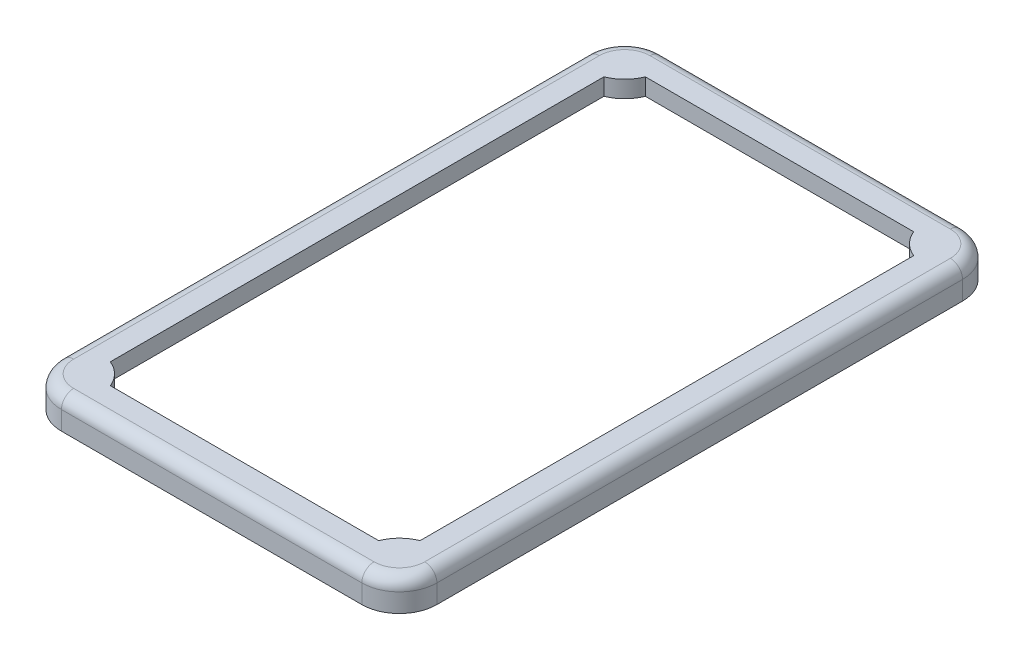
ISO-10303-21;
HEADER;
FILE_DESCRIPTION(('STEP AP214'),'2;1');
FILE_NAME('part.step','',(''),(''),'','','');
FILE_SCHEMA(('AUTOMOTIVE_DESIGN { 1 0 10303 214 1 1 1 1 }'));
ENDSEC;
DATA;
#1=APPLICATION_CONTEXT('core data for automotive mechanical design processes');
#2=APPLICATION_PROTOCOL_DEFINITION('international standard','automotive_design',2000,#1);
#3=PRODUCT_CONTEXT('',#1,'mechanical');
#4=PRODUCT('Part','Part','',(#3));
#5=PRODUCT_RELATED_PRODUCT_CATEGORY('part','',(#4));
#6=PRODUCT_DEFINITION_FORMATION('','',#4);
#7=PRODUCT_DEFINITION_CONTEXT('part definition',#1,'design');
#8=PRODUCT_DEFINITION('design','',#6,#7);
#9=PRODUCT_DEFINITION_SHAPE('','',#8);
#10=(LENGTH_UNIT() NAMED_UNIT(*) SI_UNIT(.MILLI.,.METRE.));
#11=(NAMED_UNIT(*) PLANE_ANGLE_UNIT() SI_UNIT($,.RADIAN.));
#12=(NAMED_UNIT(*) SI_UNIT($,.STERADIAN.) SOLID_ANGLE_UNIT());
#13=UNCERTAINTY_MEASURE_WITH_UNIT(LENGTH_MEASURE(1.E-05),#10,'distance_accuracy_value','');
#14=(GEOMETRIC_REPRESENTATION_CONTEXT(3) GLOBAL_UNCERTAINTY_ASSIGNED_CONTEXT((#13)) GLOBAL_UNIT_ASSIGNED_CONTEXT((#10,
#11,#12)) REPRESENTATION_CONTEXT('',''));
#15=CARTESIAN_POINT('',(0.,0.,0.));
#16=DIRECTION('',(0.,0.,1.));
#17=DIRECTION('',(1.,0.,0.));
#18=AXIS2_PLACEMENT_3D('',#15,#16,#17);
#19=CARTESIAN_POINT('',(-18.,3.3,30.));
#20=DIRECTION('',(1.,0.,0.));
#21=DIRECTION('',(0.,0.,-1.));
#22=AXIS2_PLACEMENT_3D('',#19,#20,#21);
#23=PLANE('',#22);
#24=DIRECTION('',(0.,-1.,0.));
#25=VECTOR('',#24,1.);
#26=CARTESIAN_POINT('',(-18.,3.3,-30.));
#27=LINE('',#26,#25);
#28=CARTESIAN_POINT('',(-18.,1.5,-30.));
#29=VERTEX_POINT('',#28);
#30=CARTESIAN_POINT('',(-18.,0.,-30.));
#31=VERTEX_POINT('',#30);
#32=EDGE_CURVE('E342',#29,#31,#27,.T.);
#33=ORIENTED_EDGE('',*,*,#32,.F.);
#34=DIRECTION('',(0.,0.,1.));
#35=VECTOR('',#34,1.);
#36=CARTESIAN_POINT('',(-18.,1.5,0.));
#37=LINE('',#36,#35);
#38=CARTESIAN_POINT('',(-18.,1.5,30.));
#39=VERTEX_POINT('',#38);
#40=EDGE_CURVE('E266',#29,#39,#37,.T.);
#41=ORIENTED_EDGE('',*,*,#40,.T.);
#42=DIRECTION('',(0.,-1.,0.));
#43=VECTOR('',#42,1.);
#44=CARTESIAN_POINT('',(-18.,3.3,30.));
#45=LINE('',#44,#43);
#46=CARTESIAN_POINT('',(-18.,0.,30.));
#47=VERTEX_POINT('',#46);
#48=EDGE_CURVE('E348',#39,#47,#45,.T.);
#49=ORIENTED_EDGE('',*,*,#48,.T.);
#50=DIRECTION('',(0.,0.,1.));
#51=VECTOR('',#50,1.);
#52=CARTESIAN_POINT('',(-18.,0.,30.));
#53=LINE('',#52,#51);
#54=EDGE_CURVE('E289',#31,#47,#53,.T.);
#55=ORIENTED_EDGE('',*,*,#54,.F.);
#56=EDGE_LOOP('',(#33,#41,#49,#55));
#57=FACE_BOUND('',#56,.T.);
#58=ADVANCED_FACE('F41',(#57),#23,.T.);
#59=CARTESIAN_POINT('',(18.,3.3,30.));
#60=DIRECTION('',(0.,0.,-1.));
#61=DIRECTION('',(-1.,0.,0.));
#62=AXIS2_PLACEMENT_3D('',#59,#60,#61);
#63=PLANE('',#62);
#64=ORIENTED_EDGE('',*,*,#48,.F.);
#65=DIRECTION('',(1.,0.,0.));
#66=VECTOR('',#65,1.);
#67=CARTESIAN_POINT('',(0.,1.5,30.));
#68=LINE('',#67,#66);
#69=CARTESIAN_POINT('',(18.,1.5,30.));
#70=VERTEX_POINT('',#69);
#71=EDGE_CURVE('E272',#39,#70,#68,.T.);
#72=ORIENTED_EDGE('',*,*,#71,.T.);
#73=DIRECTION('',(0.,-1.,0.));
#74=VECTOR('',#73,1.);
#75=CARTESIAN_POINT('',(18.,3.3,30.));
#76=LINE('',#75,#74);
#77=CARTESIAN_POINT('',(18.,0.,30.));
#78=VERTEX_POINT('',#77);
#79=EDGE_CURVE('E346',#70,#78,#76,.T.);
#80=ORIENTED_EDGE('',*,*,#79,.T.);
#81=DIRECTION('',(1.,0.,0.));
#82=VECTOR('',#81,1.);
#83=CARTESIAN_POINT('',(18.,0.,30.));
#84=LINE('',#83,#82);
#85=EDGE_CURVE('E333',#47,#78,#84,.T.);
#86=ORIENTED_EDGE('',*,*,#85,.F.);
#87=EDGE_LOOP('',(#64,#72,#80,#86));
#88=FACE_BOUND('',#87,.T.);
#89=ADVANCED_FACE('F515',(#88),#63,.T.);
#90=CARTESIAN_POINT('',(18.,3.3,30.));
#91=DIRECTION('',(-1.,0.,0.));
#92=DIRECTION('',(0.,0.,1.));
#93=AXIS2_PLACEMENT_3D('',#90,#91,#92);
#94=PLANE('',#93);
#95=ORIENTED_EDGE('',*,*,#79,.F.);
#96=DIRECTION('',(0.,0.,-1.));
#97=VECTOR('',#96,1.);
#98=CARTESIAN_POINT('',(18.,1.5,0.));
#99=LINE('',#98,#97);
#100=CARTESIAN_POINT('',(18.,1.5,-30.));
#101=VERTEX_POINT('',#100);
#102=EDGE_CURVE('E259',#70,#101,#99,.T.);
#103=ORIENTED_EDGE('',*,*,#102,.T.);
#104=DIRECTION('',(0.,-1.,0.));
#105=VECTOR('',#104,1.);
#106=CARTESIAN_POINT('',(18.,3.3,-30.));
#107=LINE('',#106,#105);
#108=CARTESIAN_POINT('',(18.,0.,-30.));
#109=VERTEX_POINT('',#108);
#110=EDGE_CURVE('E344',#101,#109,#107,.T.);
#111=ORIENTED_EDGE('',*,*,#110,.T.);
#112=DIRECTION('',(0.,0.,-1.));
#113=VECTOR('',#112,1.);
#114=CARTESIAN_POINT('',(18.,0.,30.));
#115=LINE('',#114,#113);
#116=EDGE_CURVE('E336',#78,#109,#115,.T.);
#117=ORIENTED_EDGE('',*,*,#116,.F.);
#118=EDGE_LOOP('',(#95,#103,#111,#117));
#119=FACE_BOUND('',#118,.T.);
#120=ADVANCED_FACE('F510',(#119),#94,.T.);
#121=CARTESIAN_POINT('',(18.,3.3,-30.));
#122=DIRECTION('',(0.,0.,1.));
#123=DIRECTION('',(1.,0.,0.));
#124=AXIS2_PLACEMENT_3D('',#121,#122,#123);
#125=PLANE('',#124);
#126=ORIENTED_EDGE('',*,*,#110,.F.);
#127=DIRECTION('',(-1.,0.,0.));
#128=VECTOR('',#127,1.);
#129=CARTESIAN_POINT('',(0.,1.5,-30.));
#130=LINE('',#129,#128);
#131=EDGE_CURVE('E262',#101,#29,#130,.T.);
#132=ORIENTED_EDGE('',*,*,#131,.T.);
#133=ORIENTED_EDGE('',*,*,#32,.T.);
#134=DIRECTION('',(-1.,0.,0.));
#135=VECTOR('',#134,1.);
#136=CARTESIAN_POINT('',(18.,0.,-30.));
#137=LINE('',#136,#135);
#138=EDGE_CURVE('E339',#109,#31,#137,.T.);
#139=ORIENTED_EDGE('',*,*,#138,.F.);
#140=EDGE_LOOP('',(#126,#132,#133,#139));
#141=FACE_BOUND('',#140,.T.);
#142=ADVANCED_FACE('F500',(#141),#125,.T.);
#143=CARTESIAN_POINT('',(0.,3.3,0.));
#144=DIRECTION('',(0.,1.,0.));
#145=DIRECTION('',(0.,0.,1.));
#146=AXIS2_PLACEMENT_3D('',#143,#144,#145);
#147=PLANE('',#146);
#148=DIRECTION('',(0.,0.,1.));
#149=VECTOR('',#148,1.);
#150=CARTESIAN_POINT('',(-18.7,3.3,28.));
#151=LINE('',#150,#149);
#152=CARTESIAN_POINT('',(-18.7,3.3,-28.));
#153=VERTEX_POINT('',#152);
#154=CARTESIAN_POINT('',(-18.7,3.3,28.));
#155=VERTEX_POINT('',#154);
#156=EDGE_CURVE('E400',#153,#155,#151,.T.);
#157=ORIENTED_EDGE('',*,*,#156,.T.);
#158=CARTESIAN_POINT('',(-16.,3.3,28.));
#159=DIRECTION('',(0.,1.,0.));
#160=DIRECTION('',(0.,0.,1.));
#161=AXIS2_PLACEMENT_3D('',#158,#159,#160);
#162=CIRCLE('',#161,2.7);
#163=CARTESIAN_POINT('',(-16.,3.3,30.7));
#164=VERTEX_POINT('',#163);
#165=EDGE_CURVE('E402',#155,#164,#162,.T.);
#166=ORIENTED_EDGE('',*,*,#165,.T.);
#167=DIRECTION('',(1.,0.,0.));
#168=VECTOR('',#167,1.);
#169=CARTESIAN_POINT('',(16.,3.3,30.7));
#170=LINE('',#169,#168);
#171=CARTESIAN_POINT('',(16.,3.3,30.7));
#172=VERTEX_POINT('',#171);
#173=EDGE_CURVE('E388',#164,#172,#170,.T.);
#174=ORIENTED_EDGE('',*,*,#173,.T.);
#175=CARTESIAN_POINT('',(16.,3.3,28.));
#176=DIRECTION('',(0.,1.,0.));
#177=DIRECTION('',(0.,0.,1.));
#178=AXIS2_PLACEMENT_3D('',#175,#176,#177);
#179=CIRCLE('',#178,2.7);
#180=CARTESIAN_POINT('',(18.7,3.3,28.));
#181=VERTEX_POINT('',#180);
#182=EDGE_CURVE('E390',#172,#181,#179,.T.);
#183=ORIENTED_EDGE('',*,*,#182,.T.);
#184=DIRECTION('',(0.,0.,-1.));
#185=VECTOR('',#184,1.);
#186=CARTESIAN_POINT('',(18.7,3.3,-28.));
#187=LINE('',#186,#185);
#188=CARTESIAN_POINT('',(18.7,3.3,-28.));
#189=VERTEX_POINT('',#188);
#190=EDGE_CURVE('E392',#181,#189,#187,.T.);
#191=ORIENTED_EDGE('',*,*,#190,.T.);
#192=CARTESIAN_POINT('',(16.,3.3,-28.));
#193=DIRECTION('',(0.,1.,0.));
#194=DIRECTION('',(0.,0.,1.));
#195=AXIS2_PLACEMENT_3D('',#192,#193,#194);
#196=CIRCLE('',#195,2.7);
#197=CARTESIAN_POINT('',(16.,3.3,-30.7));
#198=VERTEX_POINT('',#197);
#199=EDGE_CURVE('E394',#189,#198,#196,.T.);
#200=ORIENTED_EDGE('',*,*,#199,.T.);
#201=DIRECTION('',(-1.,0.,0.));
#202=VECTOR('',#201,1.);
#203=CARTESIAN_POINT('',(-16.,3.3,-30.7));
#204=LINE('',#203,#202);
#205=CARTESIAN_POINT('',(-16.,3.3,-30.7));
#206=VERTEX_POINT('',#205);
#207=EDGE_CURVE('E396',#198,#206,#204,.T.);
#208=ORIENTED_EDGE('',*,*,#207,.T.);
#209=CARTESIAN_POINT('',(-16.,3.3,-28.));
#210=DIRECTION('',(0.,1.,0.));
#211=DIRECTION('',(0.,0.,1.));
#212=AXIS2_PLACEMENT_3D('',#209,#210,#211);
#213=CIRCLE('',#212,2.7);
#214=EDGE_CURVE('E398',#206,#153,#213,.T.);
#215=ORIENTED_EDGE('',*,*,#214,.T.);
#216=EDGE_LOOP('',(#157,#166,#174,#183,#191,#200,#208,#215));
#217=FACE_BOUND('',#216,.T.);
#218=CARTESIAN_POINT('',(-18.,3.3,30.));
#219=DIRECTION('',(0.,1.,0.));
#220=DIRECTION('',(0.,0.,1.));
#221=AXIS2_PLACEMENT_3D('',#218,#219,#220);
#222=CIRCLE('',#221,3.99999999999999);
#223=CARTESIAN_POINT('',(-16.5,3.3,26.2919007564522));
#224=VERTEX_POINT('',#223);
#225=CARTESIAN_POINT('',(-14.2919007564522,3.3,28.5));
#226=VERTEX_POINT('',#225);
#227=EDGE_CURVE('E258',#224,#226,#222,.F.);
#228=ORIENTED_EDGE('',*,*,#227,.F.);
#229=DIRECTION('',(0.,0.,1.));
#230=VECTOR('',#229,1.);
#231=CARTESIAN_POINT('',(-16.5,3.3,0.));
#232=LINE('',#231,#230);
#233=CARTESIAN_POINT('',(-16.5,3.3,-26.2919007564522));
#234=VERTEX_POINT('',#233);
#235=EDGE_CURVE('E292',#234,#224,#232,.T.);
#236=ORIENTED_EDGE('',*,*,#235,.F.);
#237=CARTESIAN_POINT('',(-18.,3.3,-30.));
#238=DIRECTION('',(0.,1.,0.));
#239=DIRECTION('',(0.,0.,1.));
#240=AXIS2_PLACEMENT_3D('',#237,#238,#239);
#241=CIRCLE('',#240,3.99999999999998);
#242=CARTESIAN_POINT('',(-14.2919007564522,3.3,-28.5));
#243=VERTEX_POINT('',#242);
#244=EDGE_CURVE('E295',#234,#243,#241,.T.);
#245=ORIENTED_EDGE('',*,*,#244,.T.);
#246=DIRECTION('',(1.,0.,0.));
#247=VECTOR('',#246,1.);
#248=CARTESIAN_POINT('',(0.,3.3,-28.5));
#249=LINE('',#248,#247);
#250=CARTESIAN_POINT('',(14.2919007564522,3.3,-28.5));
#251=VERTEX_POINT('',#250);
#252=EDGE_CURVE('E298',#243,#251,#249,.T.);
#253=ORIENTED_EDGE('',*,*,#252,.T.);
#254=CARTESIAN_POINT('',(18.,3.3,-30.));
#255=DIRECTION('',(0.,1.,0.));
#256=DIRECTION('',(0.,0.,1.));
#257=AXIS2_PLACEMENT_3D('',#254,#255,#256);
#258=CIRCLE('',#257,3.99999999999999);
#259=CARTESIAN_POINT('',(16.5,3.3,-26.2919007564522));
#260=VERTEX_POINT('',#259);
#261=EDGE_CURVE('E301',#260,#251,#258,.F.);
#262=ORIENTED_EDGE('',*,*,#261,.F.);
#263=DIRECTION('',(0.,0.,1.));
#264=VECTOR('',#263,1.);
#265=CARTESIAN_POINT('',(16.5,3.3,0.));
#266=LINE('',#265,#264);
#267=CARTESIAN_POINT('',(16.5,3.3,26.2919007564522));
#268=VERTEX_POINT('',#267);
#269=EDGE_CURVE('E304',#260,#268,#266,.T.);
#270=ORIENTED_EDGE('',*,*,#269,.T.);
#271=CARTESIAN_POINT('',(18.,3.3,30.));
#272=DIRECTION('',(0.,1.,0.));
#273=DIRECTION('',(0.,0.,1.));
#274=AXIS2_PLACEMENT_3D('',#271,#272,#273);
#275=CIRCLE('',#274,3.99999999999998);
#276=CARTESIAN_POINT('',(14.2919007564522,3.3,28.5));
#277=VERTEX_POINT('',#276);
#278=EDGE_CURVE('E307',#268,#277,#275,.T.);
#279=ORIENTED_EDGE('',*,*,#278,.T.);
#280=DIRECTION('',(1.,0.,0.));
#281=VECTOR('',#280,1.);
#282=CARTESIAN_POINT('',(0.,3.3,28.5));
#283=LINE('',#282,#281);
#284=EDGE_CURVE('E310',#226,#277,#283,.T.);
#285=ORIENTED_EDGE('',*,*,#284,.F.);
#286=EDGE_LOOP('',(#228,#236,#245,#253,#262,#270,#279,#285));
#287=FACE_BOUND('',#286,.T.);
#288=ADVANCED_FACE('F497',(#217,#287),#147,.T.);
#289=CARTESIAN_POINT('',(0.,0.,0.));
#290=DIRECTION('',(0.,1.,0.));
#291=DIRECTION('',(0.,0.,1.));
#292=AXIS2_PLACEMENT_3D('',#289,#290,#291);
#293=PLANE('',#292);
#294=DIRECTION('',(-1.,0.,0.));
#295=VECTOR('',#294,1.);
#296=CARTESIAN_POINT('',(20.,0.,-32.));
#297=LINE('',#296,#295);
#298=CARTESIAN_POINT('',(16.,0.,-32.));
#299=VERTEX_POINT('',#298);
#300=CARTESIAN_POINT('',(-16.,0.,-32.));
#301=VERTEX_POINT('',#300);
#302=EDGE_CURVE('E359',#299,#301,#297,.T.);
#303=ORIENTED_EDGE('',*,*,#302,.F.);
#304=CARTESIAN_POINT('',(16.,0.,-28.));
#305=DIRECTION('',(0.,1.,0.));
#306=DIRECTION('',(0.,0.,1.));
#307=AXIS2_PLACEMENT_3D('',#304,#305,#306);
#308=CIRCLE('',#307,4.);
#309=CARTESIAN_POINT('',(20.,0.,-28.));
#310=VERTEX_POINT('',#309);
#311=EDGE_CURVE('E373',#299,#310,#308,.F.);
#312=ORIENTED_EDGE('',*,*,#311,.T.);
#313=DIRECTION('',(0.,0.,-1.));
#314=VECTOR('',#313,1.);
#315=CARTESIAN_POINT('',(20.,0.,32.));
#316=LINE('',#315,#314);
#317=CARTESIAN_POINT('',(20.,0.,28.));
#318=VERTEX_POINT('',#317);
#319=EDGE_CURVE('E356',#318,#310,#316,.T.);
#320=ORIENTED_EDGE('',*,*,#319,.F.);
#321=CARTESIAN_POINT('',(16.,0.,28.));
#322=DIRECTION('',(0.,1.,0.));
#323=DIRECTION('',(0.,0.,1.));
#324=AXIS2_PLACEMENT_3D('',#321,#322,#323);
#325=CIRCLE('',#324,4.);
#326=CARTESIAN_POINT('',(16.,0.,32.));
#327=VERTEX_POINT('',#326);
#328=EDGE_CURVE('E369',#318,#327,#325,.F.);
#329=ORIENTED_EDGE('',*,*,#328,.T.);
#330=DIRECTION('',(1.,0.,0.));
#331=VECTOR('',#330,1.);
#332=CARTESIAN_POINT('',(20.,0.,32.));
#333=LINE('',#332,#331);
#334=CARTESIAN_POINT('',(-16.,0.,32.));
#335=VERTEX_POINT('',#334);
#336=EDGE_CURVE('E353',#335,#327,#333,.T.);
#337=ORIENTED_EDGE('',*,*,#336,.F.);
#338=CARTESIAN_POINT('',(-16.,0.,28.));
#339=DIRECTION('',(0.,1.,0.));
#340=DIRECTION('',(0.,0.,1.));
#341=AXIS2_PLACEMENT_3D('',#338,#339,#340);
#342=CIRCLE('',#341,4.);
#343=CARTESIAN_POINT('',(-20.,0.,28.));
#344=VERTEX_POINT('',#343);
#345=EDGE_CURVE('E367',#335,#344,#342,.F.);
#346=ORIENTED_EDGE('',*,*,#345,.T.);
#347=DIRECTION('',(0.,0.,1.));
#348=VECTOR('',#347,1.);
#349=CARTESIAN_POINT('',(-20.,0.,32.));
#350=LINE('',#349,#348);
#351=CARTESIAN_POINT('',(-20.,0.,-28.));
#352=VERTEX_POINT('',#351);
#353=EDGE_CURVE('E350',#352,#344,#350,.T.);
#354=ORIENTED_EDGE('',*,*,#353,.F.);
#355=CARTESIAN_POINT('',(-16.,0.,-28.));
#356=DIRECTION('',(0.,1.,0.));
#357=DIRECTION('',(0.,0.,1.));
#358=AXIS2_PLACEMENT_3D('',#355,#356,#357);
#359=CIRCLE('',#358,4.);
#360=EDGE_CURVE('E371',#352,#301,#359,.F.);
#361=ORIENTED_EDGE('',*,*,#360,.T.);
#362=EDGE_LOOP('',(#303,#312,#320,#329,#337,#346,#354,#361));
#363=FACE_BOUND('',#362,.T.);
#364=ORIENTED_EDGE('',*,*,#54,.T.);
#365=ORIENTED_EDGE('',*,*,#85,.T.);
#366=ORIENTED_EDGE('',*,*,#116,.T.);
#367=ORIENTED_EDGE('',*,*,#138,.T.);
#368=EDGE_LOOP('',(#364,#365,#366,#367));
#369=FACE_BOUND('',#368,.T.);
#370=ADVANCED_FACE('F499',(#363,#369),#293,.F.);
#371=CARTESIAN_POINT('',(-20.,3.3,32.));
#372=DIRECTION('',(1.,0.,0.));
#373=DIRECTION('',(0.,0.,-1.));
#374=AXIS2_PLACEMENT_3D('',#371,#372,#373);
#375=PLANE('',#374);
#376=DIRECTION('',(0.,-1.,0.));
#377=VECTOR('',#376,1.);
#378=CARTESIAN_POINT('',(-20.,3.3,28.));
#379=LINE('',#378,#377);
#380=CARTESIAN_POINT('',(-20.,2.,28.));
#381=VERTEX_POINT('',#380);
#382=EDGE_CURVE('E379',#344,#381,#379,.F.);
#383=ORIENTED_EDGE('',*,*,#382,.T.);
#384=DIRECTION('',(0.,0.,1.));
#385=VECTOR('',#384,1.);
#386=CARTESIAN_POINT('',(-20.,2.,-28.));
#387=LINE('',#386,#385);
#388=CARTESIAN_POINT('',(-20.,2.,-28.));
#389=VERTEX_POINT('',#388);
#390=EDGE_CURVE('E408',#381,#389,#387,.F.);
#391=ORIENTED_EDGE('',*,*,#390,.T.);
#392=DIRECTION('',(0.,-1.,0.));
#393=VECTOR('',#392,1.);
#394=CARTESIAN_POINT('',(-20.,3.3,-28.));
#395=LINE('',#394,#393);
#396=EDGE_CURVE('E382',#389,#352,#395,.T.);
#397=ORIENTED_EDGE('',*,*,#396,.T.);
#398=ORIENTED_EDGE('',*,*,#353,.T.);
#399=EDGE_LOOP('',(#383,#391,#397,#398));
#400=FACE_BOUND('',#399,.T.);
#401=ADVANCED_FACE('F507',(#400),#375,.F.);
#402=CARTESIAN_POINT('',(20.,3.3,32.));
#403=DIRECTION('',(0.,0.,-1.));
#404=DIRECTION('',(-1.,0.,0.));
#405=AXIS2_PLACEMENT_3D('',#402,#403,#404);
#406=PLANE('',#405);
#407=DIRECTION('',(0.,-1.,0.));
#408=VECTOR('',#407,1.);
#409=CARTESIAN_POINT('',(16.,3.3,32.));
#410=LINE('',#409,#408);
#411=CARTESIAN_POINT('',(16.,2.,32.));
#412=VERTEX_POINT('',#411);
#413=EDGE_CURVE('E386',#327,#412,#410,.F.);
#414=ORIENTED_EDGE('',*,*,#413,.T.);
#415=DIRECTION('',(1.,0.,0.));
#416=VECTOR('',#415,1.);
#417=CARTESIAN_POINT('',(-16.,2.,32.));
#418=LINE('',#417,#416);
#419=CARTESIAN_POINT('',(-16.,2.,32.));
#420=VERTEX_POINT('',#419);
#421=EDGE_CURVE('E12',#412,#420,#418,.F.);
#422=ORIENTED_EDGE('',*,*,#421,.T.);
#423=DIRECTION('',(0.,-1.,0.));
#424=VECTOR('',#423,1.);
#425=CARTESIAN_POINT('',(-16.,3.3,32.));
#426=LINE('',#425,#424);
#427=EDGE_CURVE('E384',#420,#335,#426,.T.);
#428=ORIENTED_EDGE('',*,*,#427,.T.);
#429=ORIENTED_EDGE('',*,*,#336,.T.);
#430=EDGE_LOOP('',(#414,#422,#428,#429));
#431=FACE_BOUND('',#430,.T.);
#432=ADVANCED_FACE('F609',(#431),#406,.F.);
#433=CARTESIAN_POINT('',(20.,3.3,32.));
#434=DIRECTION('',(-1.,0.,0.));
#435=DIRECTION('',(0.,0.,1.));
#436=AXIS2_PLACEMENT_3D('',#433,#434,#435);
#437=PLANE('',#436);
#438=DIRECTION('',(0.,-1.,0.));
#439=VECTOR('',#438,1.);
#440=CARTESIAN_POINT('',(20.,3.3,-28.));
#441=LINE('',#440,#439);
#442=CARTESIAN_POINT('',(20.,2.,-28.));
#443=VERTEX_POINT('',#442);
#444=EDGE_CURVE('E377',#310,#443,#441,.F.);
#445=ORIENTED_EDGE('',*,*,#444,.T.);
#446=DIRECTION('',(0.,0.,-1.));
#447=VECTOR('',#446,1.);
#448=CARTESIAN_POINT('',(20.,2.,28.));
#449=LINE('',#448,#447);
#450=CARTESIAN_POINT('',(20.,2.,28.));
#451=VERTEX_POINT('',#450);
#452=EDGE_CURVE('E65',#443,#451,#449,.F.);
#453=ORIENTED_EDGE('',*,*,#452,.T.);
#454=DIRECTION('',(0.,-1.,0.));
#455=VECTOR('',#454,1.);
#456=CARTESIAN_POINT('',(20.,3.3,28.));
#457=LINE('',#456,#455);
#458=EDGE_CURVE('E375',#451,#318,#457,.T.);
#459=ORIENTED_EDGE('',*,*,#458,.T.);
#460=ORIENTED_EDGE('',*,*,#319,.T.);
#461=EDGE_LOOP('',(#445,#453,#459,#460));
#462=FACE_BOUND('',#461,.T.);
#463=ADVANCED_FACE('F646',(#462),#437,.F.);
#464=CARTESIAN_POINT('',(20.,3.3,-32.));
#465=DIRECTION('',(0.,0.,1.));
#466=DIRECTION('',(1.,0.,0.));
#467=AXIS2_PLACEMENT_3D('',#464,#465,#466);
#468=PLANE('',#467);
#469=DIRECTION('',(0.,-1.,0.));
#470=VECTOR('',#469,1.);
#471=CARTESIAN_POINT('',(-16.,3.3,-32.));
#472=LINE('',#471,#470);
#473=CARTESIAN_POINT('',(-16.,2.,-32.));
#474=VERTEX_POINT('',#473);
#475=EDGE_CURVE('E362',#301,#474,#472,.F.);
#476=ORIENTED_EDGE('',*,*,#475,.T.);
#477=DIRECTION('',(-1.,0.,0.));
#478=VECTOR('',#477,1.);
#479=CARTESIAN_POINT('',(16.,2.,-32.));
#480=LINE('',#479,#478);
#481=CARTESIAN_POINT('',(16.,2.,-32.));
#482=VERTEX_POINT('',#481);
#483=EDGE_CURVE('E412',#474,#482,#480,.F.);
#484=ORIENTED_EDGE('',*,*,#483,.T.);
#485=DIRECTION('',(0.,-1.,0.));
#486=VECTOR('',#485,1.);
#487=CARTESIAN_POINT('',(16.,3.3,-32.));
#488=LINE('',#487,#486);
#489=EDGE_CURVE('E365',#482,#299,#488,.T.);
#490=ORIENTED_EDGE('',*,*,#489,.T.);
#491=ORIENTED_EDGE('',*,*,#302,.T.);
#492=EDGE_LOOP('',(#476,#484,#490,#491));
#493=FACE_BOUND('',#492,.T.);
#494=ADVANCED_FACE('F531',(#493),#468,.F.);
#495=CARTESIAN_POINT('',(-16.5,-69.9714227381436,0.));
#496=DIRECTION('',(-1.,0.,0.));
#497=DIRECTION('',(0.,0.,1.));
#498=AXIS2_PLACEMENT_3D('',#495,#496,#497);
#499=PLANE('',#498);
#500=DIRECTION('',(0.,1.,0.));
#501=VECTOR('',#500,1.);
#502=CARTESIAN_POINT('',(-16.5,-69.9714227381436,26.2919007564522));
#503=LINE('',#502,#501);
#504=CARTESIAN_POINT('',(-16.5,1.5,26.2919007564522));
#505=VERTEX_POINT('',#504);
#506=EDGE_CURVE('E313',#505,#224,#503,.T.);
#507=ORIENTED_EDGE('',*,*,#506,.F.);
#508=DIRECTION('',(0.,0.,-1.));
#509=VECTOR('',#508,1.);
#510=CARTESIAN_POINT('',(-16.5,1.5,0.));
#511=LINE('',#510,#509);
#512=CARTESIAN_POINT('',(-16.5,1.5,-26.2919007564522));
#513=VERTEX_POINT('',#512);
#514=EDGE_CURVE('E263',#505,#513,#511,.T.);
#515=ORIENTED_EDGE('',*,*,#514,.T.);
#516=DIRECTION('',(0.,1.,0.));
#517=VECTOR('',#516,1.);
#518=CARTESIAN_POINT('',(-16.5,-69.9714227381436,-26.2919007564522));
#519=LINE('',#518,#517);
#520=EDGE_CURVE('E326',#513,#234,#519,.T.);
#521=ORIENTED_EDGE('',*,*,#520,.T.);
#522=ORIENTED_EDGE('',*,*,#235,.T.);
#523=EDGE_LOOP('',(#507,#515,#521,#522));
#524=FACE_BOUND('',#523,.T.);
#525=ADVANCED_FACE('F493',(#524),#499,.F.);
#526=CARTESIAN_POINT('',(-18.,-69.9714227381436,-30.));
#527=DIRECTION('',(0.,1.,0.));
#528=DIRECTION('',(0.,0.,1.));
#529=AXIS2_PLACEMENT_3D('',#526,#527,#528);
#530=CYLINDRICAL_SURFACE('',#529,3.99999999999998);
#531=CARTESIAN_POINT('',(-18.,1.5,-30.));
#532=DIRECTION('',(0.,1.,0.));
#533=DIRECTION('',(0.,0.,1.));
#534=AXIS2_PLACEMENT_3D('',#531,#532,#533);
#535=CIRCLE('',#534,3.99999999999998);
#536=CARTESIAN_POINT('',(-14.2919007564522,1.5,-28.5));
#537=VERTEX_POINT('',#536);
#538=EDGE_CURVE('E269',#537,#513,#535,.F.);
#539=ORIENTED_EDGE('',*,*,#538,.F.);
#540=DIRECTION('',(0.,1.,0.));
#541=VECTOR('',#540,1.);
#542=CARTESIAN_POINT('',(-14.2919007564522,-69.9714227381436,-28.5));
#543=LINE('',#542,#541);
#544=EDGE_CURVE('E324',#537,#243,#543,.T.);
#545=ORIENTED_EDGE('',*,*,#544,.T.);
#546=ORIENTED_EDGE('',*,*,#244,.F.);
#547=ORIENTED_EDGE('',*,*,#520,.F.);
#548=EDGE_LOOP('',(#539,#545,#546,#547));
#549=FACE_BOUND('',#548,.T.);
#550=ADVANCED_FACE('F489',(#549),#530,.T.);
#551=CARTESIAN_POINT('',(0.,-69.9714227381436,-28.5));
#552=DIRECTION('',(0.,0.,1.));
#553=DIRECTION('',(1.,0.,0.));
#554=AXIS2_PLACEMENT_3D('',#551,#552,#553);
#555=PLANE('',#554);
#556=DIRECTION('',(-1.,0.,0.));
#557=VECTOR('',#556,1.);
#558=CARTESIAN_POINT('',(0.,1.5,-28.5));
#559=LINE('',#558,#557);
#560=CARTESIAN_POINT('',(14.2919007564522,1.5,-28.5));
#561=VERTEX_POINT('',#560);
#562=EDGE_CURVE('E274',#561,#537,#559,.T.);
#563=ORIENTED_EDGE('',*,*,#562,.F.);
#564=DIRECTION('',(0.,1.,0.));
#565=VECTOR('',#564,1.);
#566=CARTESIAN_POINT('',(14.2919007564522,-69.9714227381436,-28.5));
#567=LINE('',#566,#565);
#568=EDGE_CURVE('E322',#561,#251,#567,.T.);
#569=ORIENTED_EDGE('',*,*,#568,.T.);
#570=ORIENTED_EDGE('',*,*,#252,.F.);
#571=ORIENTED_EDGE('',*,*,#544,.F.);
#572=EDGE_LOOP('',(#563,#569,#570,#571));
#573=FACE_BOUND('',#572,.T.);
#574=ADVANCED_FACE('F484',(#573),#555,.T.);
#575=CARTESIAN_POINT('',(18.,-69.9714227381436,-30.));
#576=DIRECTION('',(0.,1.,0.));
#577=DIRECTION('',(0.,0.,1.));
#578=AXIS2_PLACEMENT_3D('',#575,#576,#577);
#579=CYLINDRICAL_SURFACE('',#578,3.99999999999999);
#580=ORIENTED_EDGE('',*,*,#568,.F.);
#581=CARTESIAN_POINT('',(18.,1.5,-30.));
#582=DIRECTION('',(0.,1.,0.));
#583=DIRECTION('',(0.,0.,1.));
#584=AXIS2_PLACEMENT_3D('',#581,#582,#583);
#585=CIRCLE('',#584,3.99999999999999);
#586=CARTESIAN_POINT('',(16.5,1.5,-26.2919007564522));
#587=VERTEX_POINT('',#586);
#588=EDGE_CURVE('E276',#561,#587,#585,.T.);
#589=ORIENTED_EDGE('',*,*,#588,.T.);
#590=DIRECTION('',(0.,1.,0.));
#591=VECTOR('',#590,1.);
#592=CARTESIAN_POINT('',(16.5,-69.9714227381436,-26.2919007564522));
#593=LINE('',#592,#591);
#594=EDGE_CURVE('E320',#587,#260,#593,.T.);
#595=ORIENTED_EDGE('',*,*,#594,.T.);
#596=ORIENTED_EDGE('',*,*,#261,.T.);
#597=EDGE_LOOP('',(#580,#589,#595,#596));
#598=FACE_BOUND('',#597,.T.);
#599=ADVANCED_FACE('F480',(#598),#579,.T.);
#600=CARTESIAN_POINT('',(16.5,-69.9714227381436,0.));
#601=DIRECTION('',(-1.,0.,0.));
#602=DIRECTION('',(0.,0.,1.));
#603=AXIS2_PLACEMENT_3D('',#600,#601,#602);
#604=PLANE('',#603);
#605=DIRECTION('',(0.,0.,-1.));
#606=VECTOR('',#605,1.);
#607=CARTESIAN_POINT('',(16.5,1.5,0.));
#608=LINE('',#607,#606);
#609=CARTESIAN_POINT('',(16.5,1.5,26.2919007564522));
#610=VERTEX_POINT('',#609);
#611=EDGE_CURVE('E279',#610,#587,#608,.T.);
#612=ORIENTED_EDGE('',*,*,#611,.F.);
#613=DIRECTION('',(0.,1.,0.));
#614=VECTOR('',#613,1.);
#615=CARTESIAN_POINT('',(16.5,-69.9714227381436,26.2919007564522));
#616=LINE('',#615,#614);
#617=EDGE_CURVE('E318',#610,#268,#616,.T.);
#618=ORIENTED_EDGE('',*,*,#617,.T.);
#619=ORIENTED_EDGE('',*,*,#269,.F.);
#620=ORIENTED_EDGE('',*,*,#594,.F.);
#621=EDGE_LOOP('',(#612,#618,#619,#620));
#622=FACE_BOUND('',#621,.T.);
#623=ADVANCED_FACE('F475',(#622),#604,.T.);
#624=CARTESIAN_POINT('',(18.,-69.9714227381436,30.));
#625=DIRECTION('',(0.,1.,0.));
#626=DIRECTION('',(0.,0.,1.));
#627=AXIS2_PLACEMENT_3D('',#624,#625,#626);
#628=CYLINDRICAL_SURFACE('',#627,3.99999999999998);
#629=CARTESIAN_POINT('',(18.,1.5,30.));
#630=DIRECTION('',(0.,1.,0.));
#631=DIRECTION('',(0.,0.,1.));
#632=AXIS2_PLACEMENT_3D('',#629,#630,#631);
#633=CIRCLE('',#632,3.99999999999998);
#634=CARTESIAN_POINT('',(14.2919007564522,1.5,28.5));
#635=VERTEX_POINT('',#634);
#636=EDGE_CURVE('E281',#635,#610,#633,.F.);
#637=ORIENTED_EDGE('',*,*,#636,.F.);
#638=DIRECTION('',(0.,1.,0.));
#639=VECTOR('',#638,1.);
#640=CARTESIAN_POINT('',(14.2919007564522,-69.9714227381436,28.5));
#641=LINE('',#640,#639);
#642=EDGE_CURVE('E316',#635,#277,#641,.T.);
#643=ORIENTED_EDGE('',*,*,#642,.T.);
#644=ORIENTED_EDGE('',*,*,#278,.F.);
#645=ORIENTED_EDGE('',*,*,#617,.F.);
#646=EDGE_LOOP('',(#637,#643,#644,#645));
#647=FACE_BOUND('',#646,.T.);
#648=ADVANCED_FACE('F470',(#647),#628,.T.);
#649=CARTESIAN_POINT('',(0.,-69.9714227381436,28.5));
#650=DIRECTION('',(0.,0.,1.));
#651=DIRECTION('',(1.,0.,0.));
#652=AXIS2_PLACEMENT_3D('',#649,#650,#651);
#653=PLANE('',#652);
#654=ORIENTED_EDGE('',*,*,#642,.F.);
#655=DIRECTION('',(-1.,0.,0.));
#656=VECTOR('',#655,1.);
#657=CARTESIAN_POINT('',(0.,1.5,28.5));
#658=LINE('',#657,#656);
#659=CARTESIAN_POINT('',(-14.2919007564522,1.5,28.5));
#660=VERTEX_POINT('',#659);
#661=EDGE_CURVE('E283',#635,#660,#658,.T.);
#662=ORIENTED_EDGE('',*,*,#661,.T.);
#663=DIRECTION('',(0.,1.,0.));
#664=VECTOR('',#663,1.);
#665=CARTESIAN_POINT('',(-14.2919007564522,-69.9714227381436,28.5));
#666=LINE('',#665,#664);
#667=EDGE_CURVE('E314',#660,#226,#666,.T.);
#668=ORIENTED_EDGE('',*,*,#667,.T.);
#669=ORIENTED_EDGE('',*,*,#284,.T.);
#670=EDGE_LOOP('',(#654,#662,#668,#669));
#671=FACE_BOUND('',#670,.T.);
#672=ADVANCED_FACE('F466',(#671),#653,.F.);
#673=CARTESIAN_POINT('',(-18.,-69.9714227381436,30.));
#674=DIRECTION('',(0.,1.,0.));
#675=DIRECTION('',(0.,0.,1.));
#676=AXIS2_PLACEMENT_3D('',#673,#674,#675);
#677=CYLINDRICAL_SURFACE('',#676,3.99999999999999);
#678=ORIENTED_EDGE('',*,*,#667,.F.);
#679=CARTESIAN_POINT('',(-18.,1.5,30.));
#680=DIRECTION('',(0.,1.,0.));
#681=DIRECTION('',(0.,0.,1.));
#682=AXIS2_PLACEMENT_3D('',#679,#680,#681);
#683=CIRCLE('',#682,3.99999999999999);
#684=EDGE_CURVE('E286',#660,#505,#683,.T.);
#685=ORIENTED_EDGE('',*,*,#684,.T.);
#686=ORIENTED_EDGE('',*,*,#506,.T.);
#687=ORIENTED_EDGE('',*,*,#227,.T.);
#688=EDGE_LOOP('',(#678,#685,#686,#687));
#689=FACE_BOUND('',#688,.T.);
#690=ADVANCED_FACE('F452',(#689),#677,.T.);
#691=CARTESIAN_POINT('',(0.,1.5,0.));
#692=DIRECTION('',(0.,1.,0.));
#693=DIRECTION('',(0.,0.,1.));
#694=AXIS2_PLACEMENT_3D('',#691,#692,#693);
#695=PLANE('',#694);
#696=CARTESIAN_POINT('',(-16.5857864376269,1.5,28.5857864376269));
#697=DIRECTION('',(0.,-1.,0.));
#698=DIRECTION('',(0.,0.,-1.));
#699=AXIS2_PLACEMENT_3D('',#696,#697,#698);
#700=CIRCLE('',#699,1.125);
#701=CARTESIAN_POINT('',(-16.5857864376269,1.5,27.4607864376269));
#702=VERTEX_POINT('',#701);
#703=EDGE_CURVE('E231',#702,#702,#700,.T.);
#704=ORIENTED_EDGE('',*,*,#703,.F.);
#705=EDGE_LOOP('',(#704));
#706=FACE_BOUND('',#705,.T.);
#707=CARTESIAN_POINT('',(16.5857864376269,1.5,28.5857864376269));
#708=DIRECTION('',(0.,-1.,0.));
#709=DIRECTION('',(0.,0.,-1.));
#710=AXIS2_PLACEMENT_3D('',#707,#708,#709);
#711=CIRCLE('',#710,1.125);
#712=CARTESIAN_POINT('',(16.5857864376269,1.5,27.4607864376269));
#713=VERTEX_POINT('',#712);
#714=EDGE_CURVE('E224',#713,#713,#711,.T.);
#715=ORIENTED_EDGE('',*,*,#714,.F.);
#716=EDGE_LOOP('',(#715));
#717=FACE_BOUND('',#716,.T.);
#718=CARTESIAN_POINT('',(-16.5857864376269,1.5,-28.5857864376269));
#719=DIRECTION('',(0.,-1.,0.));
#720=DIRECTION('',(0.,0.,-1.));
#721=AXIS2_PLACEMENT_3D('',#718,#719,#720);
#722=CIRCLE('',#721,1.125);
#723=CARTESIAN_POINT('',(-16.5857864376269,1.5,-29.7107864376269));
#724=VERTEX_POINT('',#723);
#725=EDGE_CURVE('E240',#724,#724,#722,.T.);
#726=ORIENTED_EDGE('',*,*,#725,.F.);
#727=EDGE_LOOP('',(#726));
#728=FACE_BOUND('',#727,.T.);
#729=CARTESIAN_POINT('',(16.5857864376269,1.5,-28.5857864376269));
#730=DIRECTION('',(0.,-1.,0.));
#731=DIRECTION('',(0.,0.,-1.));
#732=AXIS2_PLACEMENT_3D('',#729,#730,#731);
#733=CIRCLE('',#732,1.125);
#734=CARTESIAN_POINT('',(16.5857864376269,1.5,-29.7107864376269));
#735=VERTEX_POINT('',#734);
#736=EDGE_CURVE('E249',#735,#735,#733,.T.);
#737=ORIENTED_EDGE('',*,*,#736,.F.);
#738=EDGE_LOOP('',(#737));
#739=FACE_BOUND('',#738,.T.);
#740=ORIENTED_EDGE('',*,*,#131,.F.);
#741=ORIENTED_EDGE('',*,*,#102,.F.);
#742=ORIENTED_EDGE('',*,*,#71,.F.);
#743=ORIENTED_EDGE('',*,*,#40,.F.);
#744=EDGE_LOOP('',(#740,#741,#742,#743));
#745=FACE_BOUND('',#744,.T.);
#746=ORIENTED_EDGE('',*,*,#661,.F.);
#747=ORIENTED_EDGE('',*,*,#636,.T.);
#748=ORIENTED_EDGE('',*,*,#611,.T.);
#749=ORIENTED_EDGE('',*,*,#588,.F.);
#750=ORIENTED_EDGE('',*,*,#562,.T.);
#751=ORIENTED_EDGE('',*,*,#538,.T.);
#752=ORIENTED_EDGE('',*,*,#514,.F.);
#753=ORIENTED_EDGE('',*,*,#684,.F.);
#754=EDGE_LOOP('',(#746,#747,#748,#749,#750,#751,#752,#753));
#755=FACE_BOUND('',#754,.T.);
#756=ADVANCED_FACE('F448',(#706,#717,#728,#739,#745,#755),#695,.F.);
#757=CARTESIAN_POINT('',(16.,3.3,-28.));
#758=DIRECTION('',(0.,-1.,0.));
#759=DIRECTION('',(0.,0.,-1.));
#760=AXIS2_PLACEMENT_3D('',#757,#758,#759);
#761=CYLINDRICAL_SURFACE('',#760,4.);
#762=ORIENTED_EDGE('',*,*,#489,.F.);
#763=CARTESIAN_POINT('',(16.,2.,-28.));
#764=DIRECTION('',(0.,1.,0.));
#765=DIRECTION('',(0.,0.,1.));
#766=AXIS2_PLACEMENT_3D('',#763,#764,#765);
#767=CIRCLE('',#766,4.);
#768=EDGE_CURVE('E414',#482,#443,#767,.F.);
#769=ORIENTED_EDGE('',*,*,#768,.T.);
#770=ORIENTED_EDGE('',*,*,#444,.F.);
#771=ORIENTED_EDGE('',*,*,#311,.F.);
#772=EDGE_LOOP('',(#762,#769,#770,#771));
#773=FACE_BOUND('',#772,.T.);
#774=ADVANCED_FACE('F451',(#773),#761,.T.);
#775=CARTESIAN_POINT('',(-16.,3.3,-28.));
#776=DIRECTION('',(0.,-1.,0.));
#777=DIRECTION('',(0.,0.,-1.));
#778=AXIS2_PLACEMENT_3D('',#775,#776,#777);
#779=CYLINDRICAL_SURFACE('',#778,4.);
#780=ORIENTED_EDGE('',*,*,#396,.F.);
#781=CARTESIAN_POINT('',(-16.,2.,-28.));
#782=DIRECTION('',(0.,1.,0.));
#783=DIRECTION('',(0.,0.,1.));
#784=AXIS2_PLACEMENT_3D('',#781,#782,#783);
#785=CIRCLE('',#784,4.);
#786=EDGE_CURVE('E410',#389,#474,#785,.F.);
#787=ORIENTED_EDGE('',*,*,#786,.T.);
#788=ORIENTED_EDGE('',*,*,#475,.F.);
#789=ORIENTED_EDGE('',*,*,#360,.F.);
#790=EDGE_LOOP('',(#780,#787,#788,#789));
#791=FACE_BOUND('',#790,.T.);
#792=ADVANCED_FACE('F629',(#791),#779,.T.);
#793=CARTESIAN_POINT('',(16.,3.3,28.));
#794=DIRECTION('',(0.,-1.,0.));
#795=DIRECTION('',(0.,0.,-1.));
#796=AXIS2_PLACEMENT_3D('',#793,#794,#795);
#797=CYLINDRICAL_SURFACE('',#796,4.);
#798=ORIENTED_EDGE('',*,*,#458,.F.);
#799=CARTESIAN_POINT('',(16.,2.,28.));
#800=DIRECTION('',(0.,1.,0.));
#801=DIRECTION('',(0.,0.,1.));
#802=AXIS2_PLACEMENT_3D('',#799,#800,#801);
#803=CIRCLE('',#802,4.);
#804=EDGE_CURVE('E50',#451,#412,#803,.F.);
#805=ORIENTED_EDGE('',*,*,#804,.T.);
#806=ORIENTED_EDGE('',*,*,#413,.F.);
#807=ORIENTED_EDGE('',*,*,#328,.F.);
#808=EDGE_LOOP('',(#798,#805,#806,#807));
#809=FACE_BOUND('',#808,.T.);
#810=ADVANCED_FACE('F645',(#809),#797,.T.);
#811=CARTESIAN_POINT('',(-16.,3.3,28.));
#812=DIRECTION('',(0.,-1.,0.));
#813=DIRECTION('',(0.,0.,-1.));
#814=AXIS2_PLACEMENT_3D('',#811,#812,#813);
#815=CYLINDRICAL_SURFACE('',#814,4.);
#816=ORIENTED_EDGE('',*,*,#427,.F.);
#817=CARTESIAN_POINT('',(-16.,2.,28.));
#818=DIRECTION('',(0.,1.,0.));
#819=DIRECTION('',(0.,0.,1.));
#820=AXIS2_PLACEMENT_3D('',#817,#818,#819);
#821=CIRCLE('',#820,4.);
#822=EDGE_CURVE('E405',#420,#381,#821,.F.);
#823=ORIENTED_EDGE('',*,*,#822,.T.);
#824=ORIENTED_EDGE('',*,*,#382,.F.);
#825=ORIENTED_EDGE('',*,*,#345,.F.);
#826=EDGE_LOOP('',(#816,#823,#824,#825));
#827=FACE_BOUND('',#826,.T.);
#828=ADVANCED_FACE('F548',(#827),#815,.T.);
#829=CARTESIAN_POINT('',(16.5857864376269,2.7,-28.5857864376269));
#830=DIRECTION('',(0.,-1.,0.));
#831=DIRECTION('',(0.,0.,-1.));
#832=AXIS2_PLACEMENT_3D('',#829,#830,#831);
#833=CONICAL_SURFACE('',#832,0.875000000000001,1.02974425867666);
#834=CARTESIAN_POINT('',(16.5857864376269,3.22575304164912,-28.5857864376269));
#835=VERTEX_POINT('',#834);
#836=VERTEX_LOOP('',#835);
#837=FACE_BOUND('',#836,.T.);
#838=CARTESIAN_POINT('',(16.5857864376269,2.7,-28.5857864376269));
#839=DIRECTION('',(0.,-1.,0.));
#840=DIRECTION('',(0.,0.,-1.));
#841=AXIS2_PLACEMENT_3D('',#838,#839,#840);
#842=CIRCLE('',#841,0.875000000000001);
#843=CARTESIAN_POINT('',(16.5857864376269,2.7,-29.4607864376269));
#844=VERTEX_POINT('',#843);
#845=EDGE_CURVE('E255',#844,#844,#842,.T.);
#846=ORIENTED_EDGE('',*,*,#845,.T.);
#847=EDGE_LOOP('',(#846));
#848=FACE_BOUND('',#847,.T.);
#849=ADVANCED_FACE('F544',(#837,#848),#833,.F.);
#850=CARTESIAN_POINT('',(16.5857864376269,1.5,-28.5857864376269));
#851=DIRECTION('',(0.,-1.,0.));
#852=DIRECTION('',(0.,0.,-1.));
#853=AXIS2_PLACEMENT_3D('',#850,#851,#852);
#854=CYLINDRICAL_SURFACE('',#853,0.875000000000001);
#855=ORIENTED_EDGE('',*,*,#845,.F.);
#856=EDGE_LOOP('',(#855));
#857=FACE_BOUND('',#856,.T.);
#858=CARTESIAN_POINT('',(16.5857864376269,1.75,-28.5857864376269));
#859=DIRECTION('',(0.,-1.,0.));
#860=DIRECTION('',(0.,0.,-1.));
#861=AXIS2_PLACEMENT_3D('',#858,#859,#860);
#862=CIRCLE('',#861,0.875000000000001);
#863=CARTESIAN_POINT('',(16.5857864376269,1.75,-29.4607864376269));
#864=VERTEX_POINT('',#863);
#865=EDGE_CURVE('E252',#864,#864,#862,.T.);
#866=ORIENTED_EDGE('',*,*,#865,.T.);
#867=EDGE_LOOP('',(#866));
#868=FACE_BOUND('',#867,.T.);
#869=ADVANCED_FACE('F547',(#857,#868),#854,.F.);
#870=CARTESIAN_POINT('',(16.5857864376269,1.5,-28.5857864376269));
#871=DIRECTION('',(0.,-1.,0.));
#872=DIRECTION('',(0.,0.,-1.));
#873=AXIS2_PLACEMENT_3D('',#870,#871,#872);
#874=CONICAL_SURFACE('',#873,1.125,0.785398163397449);
#875=ORIENTED_EDGE('',*,*,#865,.F.);
#876=EDGE_LOOP('',(#875));
#877=FACE_BOUND('',#876,.T.);
#878=ORIENTED_EDGE('',*,*,#736,.T.);
#879=EDGE_LOOP('',(#878));
#880=FACE_BOUND('',#879,.T.);
#881=ADVANCED_FACE('F552',(#877,#880),#874,.F.);
#882=CARTESIAN_POINT('',(-16.5857864376269,2.7,-28.5857864376269));
#883=DIRECTION('',(0.,-1.,0.));
#884=DIRECTION('',(0.,0.,-1.));
#885=AXIS2_PLACEMENT_3D('',#882,#883,#884);
#886=CONICAL_SURFACE('',#885,0.875000000000001,1.02974425867666);
#887=CARTESIAN_POINT('',(-16.5857864376269,3.22575304164912,-28.5857864376269));
#888=VERTEX_POINT('',#887);
#889=VERTEX_LOOP('',#888);
#890=FACE_BOUND('',#889,.T.);
#891=CARTESIAN_POINT('',(-16.5857864376269,2.7,-28.5857864376269));
#892=DIRECTION('',(0.,-1.,0.));
#893=DIRECTION('',(0.,0.,-1.));
#894=AXIS2_PLACEMENT_3D('',#891,#892,#893);
#895=CIRCLE('',#894,0.875000000000001);
#896=CARTESIAN_POINT('',(-16.5857864376269,2.7,-29.4607864376269));
#897=VERTEX_POINT('',#896);
#898=EDGE_CURVE('E246',#897,#897,#895,.T.);
#899=ORIENTED_EDGE('',*,*,#898,.T.);
#900=EDGE_LOOP('',(#899));
#901=FACE_BOUND('',#900,.T.);
#902=ADVANCED_FACE('F556',(#890,#901),#886,.F.);
#903=CARTESIAN_POINT('',(-16.5857864376269,1.5,-28.5857864376269));
#904=DIRECTION('',(0.,-1.,0.));
#905=DIRECTION('',(0.,0.,-1.));
#906=AXIS2_PLACEMENT_3D('',#903,#904,#905);
#907=CYLINDRICAL_SURFACE('',#906,0.875000000000001);
#908=ORIENTED_EDGE('',*,*,#898,.F.);
#909=EDGE_LOOP('',(#908));
#910=FACE_BOUND('',#909,.T.);
#911=CARTESIAN_POINT('',(-16.5857864376269,1.75,-28.5857864376269));
#912=DIRECTION('',(0.,-1.,0.));
#913=DIRECTION('',(0.,0.,-1.));
#914=AXIS2_PLACEMENT_3D('',#911,#912,#913);
#915=CIRCLE('',#914,0.875000000000001);
#916=CARTESIAN_POINT('',(-16.5857864376269,1.75,-29.4607864376269));
#917=VERTEX_POINT('',#916);
#918=EDGE_CURVE('E243',#917,#917,#915,.T.);
#919=ORIENTED_EDGE('',*,*,#918,.T.);
#920=EDGE_LOOP('',(#919));
#921=FACE_BOUND('',#920,.T.);
#922=ADVANCED_FACE('F560',(#910,#921),#907,.F.);
#923=CARTESIAN_POINT('',(-16.5857864376269,1.5,-28.5857864376269));
#924=DIRECTION('',(0.,-1.,0.));
#925=DIRECTION('',(0.,0.,-1.));
#926=AXIS2_PLACEMENT_3D('',#923,#924,#925);
#927=CONICAL_SURFACE('',#926,1.125,0.785398163397449);
#928=ORIENTED_EDGE('',*,*,#918,.F.);
#929=EDGE_LOOP('',(#928));
#930=FACE_BOUND('',#929,.T.);
#931=ORIENTED_EDGE('',*,*,#725,.T.);
#932=EDGE_LOOP('',(#931));
#933=FACE_BOUND('',#932,.T.);
#934=ADVANCED_FACE('F564',(#930,#933),#927,.F.);
#935=CARTESIAN_POINT('',(16.5857864376269,2.7,28.5857864376269));
#936=DIRECTION('',(0.,-1.,0.));
#937=DIRECTION('',(0.,0.,-1.));
#938=AXIS2_PLACEMENT_3D('',#935,#936,#937);
#939=CONICAL_SURFACE('',#938,0.875000000000001,1.02974425867666);
#940=CARTESIAN_POINT('',(16.5857864376269,3.22575304164912,28.5857864376269));
#941=VERTEX_POINT('',#940);
#942=VERTEX_LOOP('',#941);
#943=FACE_BOUND('',#942,.T.);
#944=CARTESIAN_POINT('',(16.5857864376269,2.7,28.5857864376269));
#945=DIRECTION('',(0.,-1.,0.));
#946=DIRECTION('',(0.,0.,-1.));
#947=AXIS2_PLACEMENT_3D('',#944,#945,#946);
#948=CIRCLE('',#947,0.875000000000001);
#949=CARTESIAN_POINT('',(16.5857864376269,2.7,27.7107864376269));
#950=VERTEX_POINT('',#949);
#951=EDGE_CURVE('E237',#950,#950,#948,.T.);
#952=ORIENTED_EDGE('',*,*,#951,.T.);
#953=EDGE_LOOP('',(#952));
#954=FACE_BOUND('',#953,.T.);
#955=ADVANCED_FACE('F568',(#943,#954),#939,.F.);
#956=CARTESIAN_POINT('',(16.5857864376269,1.5,28.5857864376269));
#957=DIRECTION('',(0.,-1.,0.));
#958=DIRECTION('',(0.,0.,-1.));
#959=AXIS2_PLACEMENT_3D('',#956,#957,#958);
#960=CYLINDRICAL_SURFACE('',#959,0.875000000000001);
#961=ORIENTED_EDGE('',*,*,#951,.F.);
#962=EDGE_LOOP('',(#961));
#963=FACE_BOUND('',#962,.T.);
#964=CARTESIAN_POINT('',(16.5857864376269,1.75,28.5857864376269));
#965=DIRECTION('',(0.,-1.,0.));
#966=DIRECTION('',(0.,0.,-1.));
#967=AXIS2_PLACEMENT_3D('',#964,#965,#966);
#968=CIRCLE('',#967,0.875000000000001);
#969=CARTESIAN_POINT('',(16.5857864376269,1.75,27.7107864376269));
#970=VERTEX_POINT('',#969);
#971=EDGE_CURVE('E228',#970,#970,#968,.T.);
#972=ORIENTED_EDGE('',*,*,#971,.T.);
#973=EDGE_LOOP('',(#972));
#974=FACE_BOUND('',#973,.T.);
#975=ADVANCED_FACE('F572',(#963,#974),#960,.F.);
#976=CARTESIAN_POINT('',(16.5857864376269,1.5,28.5857864376269));
#977=DIRECTION('',(0.,-1.,0.));
#978=DIRECTION('',(0.,0.,-1.));
#979=AXIS2_PLACEMENT_3D('',#976,#977,#978);
#980=CONICAL_SURFACE('',#979,1.125,0.785398163397449);
#981=ORIENTED_EDGE('',*,*,#971,.F.);
#982=EDGE_LOOP('',(#981));
#983=FACE_BOUND('',#982,.T.);
#984=ORIENTED_EDGE('',*,*,#714,.T.);
#985=EDGE_LOOP('',(#984));
#986=FACE_BOUND('',#985,.T.);
#987=ADVANCED_FACE('F218',(#983,#986),#980,.F.);
#988=CARTESIAN_POINT('',(-16.5857864376269,2.7,28.5857864376269));
#989=DIRECTION('',(0.,-1.,0.));
#990=DIRECTION('',(0.,0.,-1.));
#991=AXIS2_PLACEMENT_3D('',#988,#989,#990);
#992=CONICAL_SURFACE('',#991,0.875000000000001,1.02974425867666);
#993=CARTESIAN_POINT('',(-16.5857864376269,3.22575304164912,28.5857864376269));
#994=VERTEX_POINT('',#993);
#995=VERTEX_LOOP('',#994);
#996=FACE_BOUND('',#995,.T.);
#997=CARTESIAN_POINT('',(-16.5857864376269,2.7,28.5857864376269));
#998=DIRECTION('',(0.,-1.,0.));
#999=DIRECTION('',(0.,0.,-1.));
#1000=AXIS2_PLACEMENT_3D('',#997,#998,#999);
#1001=CIRCLE('',#1000,0.875000000000001);
#1002=CARTESIAN_POINT('',(-16.5857864376269,2.7,27.7107864376269));
#1003=VERTEX_POINT('',#1002);
#1004=EDGE_CURVE('E222',#1003,#1003,#1001,.T.);
#1005=ORIENTED_EDGE('',*,*,#1004,.T.);
#1006=EDGE_LOOP('',(#1005));
#1007=FACE_BOUND('',#1006,.T.);
#1008=ADVANCED_FACE('F214',(#996,#1007),#992,.F.);
#1009=CARTESIAN_POINT('',(-16.5857864376269,1.5,28.5857864376269));
#1010=DIRECTION('',(0.,-1.,0.));
#1011=DIRECTION('',(0.,0.,-1.));
#1012=AXIS2_PLACEMENT_3D('',#1009,#1010,#1011);
#1013=CYLINDRICAL_SURFACE('',#1012,0.875000000000001);
#1014=ORIENTED_EDGE('',*,*,#1004,.F.);
#1015=EDGE_LOOP('',(#1014));
#1016=FACE_BOUND('',#1015,.T.);
#1017=CARTESIAN_POINT('',(-16.5857864376269,1.75,28.5857864376269));
#1018=DIRECTION('',(0.,-1.,0.));
#1019=DIRECTION('',(0.,0.,-1.));
#1020=AXIS2_PLACEMENT_3D('',#1017,#1018,#1019);
#1021=CIRCLE('',#1020,0.875000000000001);
#1022=CARTESIAN_POINT('',(-16.5857864376269,1.75,27.7107864376269));
#1023=VERTEX_POINT('',#1022);
#1024=EDGE_CURVE('E225',#1023,#1023,#1021,.T.);
#1025=ORIENTED_EDGE('',*,*,#1024,.T.);
#1026=EDGE_LOOP('',(#1025));
#1027=FACE_BOUND('',#1026,.T.);
#1028=ADVANCED_FACE('F217',(#1016,#1027),#1013,.F.);
#1029=CARTESIAN_POINT('',(-16.5857864376269,1.5,28.5857864376269));
#1030=DIRECTION('',(0.,-1.,0.));
#1031=DIRECTION('',(0.,0.,-1.));
#1032=AXIS2_PLACEMENT_3D('',#1029,#1030,#1031);
#1033=CONICAL_SURFACE('',#1032,1.125,0.785398163397449);
#1034=ORIENTED_EDGE('',*,*,#1024,.F.);
#1035=EDGE_LOOP('',(#1034));
#1036=FACE_BOUND('',#1035,.T.);
#1037=ORIENTED_EDGE('',*,*,#703,.T.);
#1038=EDGE_LOOP('',(#1037));
#1039=FACE_BOUND('',#1038,.T.);
#1040=ADVANCED_FACE('F446',(#1036,#1039),#1033,.F.);
#1041=CARTESIAN_POINT('',(16.,2.,-28.));
#1042=DIRECTION('',(0.,1.,0.));
#1043=DIRECTION('',(0.,0.,1.));
#1044=AXIS2_PLACEMENT_3D('',#1041,#1042,#1043);
#1045=TOROIDAL_SURFACE('',#1044,2.7,1.3);
#1046=CARTESIAN_POINT('',(18.7,2.,-28.));
#1047=DIRECTION('',(0.,0.,1.));
#1048=DIRECTION('',(1.,0.,0.));
#1049=AXIS2_PLACEMENT_3D('',#1046,#1047,#1048);
#1050=CIRCLE('',#1049,1.3);
#1051=EDGE_CURVE('E433',#443,#189,#1050,.T.);
#1052=ORIENTED_EDGE('',*,*,#1051,.F.);
#1053=ORIENTED_EDGE('',*,*,#768,.F.);
#1054=CARTESIAN_POINT('',(16.,2.,-30.7));
#1055=DIRECTION('',(-1.,0.,0.));
#1056=DIRECTION('',(0.,0.,1.));
#1057=AXIS2_PLACEMENT_3D('',#1054,#1055,#1056);
#1058=CIRCLE('',#1057,1.3);
#1059=EDGE_CURVE('E45',#198,#482,#1058,.T.);
#1060=ORIENTED_EDGE('',*,*,#1059,.F.);
#1061=ORIENTED_EDGE('',*,*,#199,.F.);
#1062=EDGE_LOOP('',(#1052,#1053,#1060,#1061));
#1063=FACE_BOUND('',#1062,.T.);
#1064=ADVANCED_FACE('F43',(#1063),#1045,.T.);
#1065=CARTESIAN_POINT('',(0.,2.,-30.7));
#1066=DIRECTION('',(1.,0.,0.));
#1067=DIRECTION('',(0.,0.,-1.));
#1068=AXIS2_PLACEMENT_3D('',#1065,#1066,#1067);
#1069=CYLINDRICAL_SURFACE('',#1068,1.3);
#1070=ORIENTED_EDGE('',*,*,#1059,.T.);
#1071=ORIENTED_EDGE('',*,*,#483,.F.);
#1072=CARTESIAN_POINT('',(-16.,2.,-30.7));
#1073=DIRECTION('',(-1.,0.,0.));
#1074=DIRECTION('',(0.,0.,1.));
#1075=AXIS2_PLACEMENT_3D('',#1072,#1073,#1074);
#1076=CIRCLE('',#1075,1.3);
#1077=EDGE_CURVE('E431',#206,#474,#1076,.T.);
#1078=ORIENTED_EDGE('',*,*,#1077,.F.);
#1079=ORIENTED_EDGE('',*,*,#207,.F.);
#1080=EDGE_LOOP('',(#1070,#1071,#1078,#1079));
#1081=FACE_BOUND('',#1080,.T.);
#1082=ADVANCED_FACE('F587',(#1081),#1069,.T.);
#1083=CARTESIAN_POINT('',(18.7,2.,0.));
#1084=DIRECTION('',(0.,0.,1.));
#1085=DIRECTION('',(1.,0.,0.));
#1086=AXIS2_PLACEMENT_3D('',#1083,#1084,#1085);
#1087=CYLINDRICAL_SURFACE('',#1086,1.3);
#1088=ORIENTED_EDGE('',*,*,#1051,.T.);
#1089=ORIENTED_EDGE('',*,*,#190,.F.);
#1090=CARTESIAN_POINT('',(18.7,2.,28.));
#1091=DIRECTION('',(0.,0.,1.));
#1092=DIRECTION('',(1.,0.,0.));
#1093=AXIS2_PLACEMENT_3D('',#1090,#1091,#1092);
#1094=CIRCLE('',#1093,1.3);
#1095=EDGE_CURVE('E428',#451,#181,#1094,.T.);
#1096=ORIENTED_EDGE('',*,*,#1095,.F.);
#1097=ORIENTED_EDGE('',*,*,#452,.F.);
#1098=EDGE_LOOP('',(#1088,#1089,#1096,#1097));
#1099=FACE_BOUND('',#1098,.T.);
#1100=ADVANCED_FACE('F594',(#1099),#1087,.T.);
#1101=CARTESIAN_POINT('',(-16.,2.,-28.));
#1102=DIRECTION('',(0.,1.,0.));
#1103=DIRECTION('',(0.,0.,1.));
#1104=AXIS2_PLACEMENT_3D('',#1101,#1102,#1103);
#1105=TOROIDAL_SURFACE('',#1104,2.7,1.3);
#1106=ORIENTED_EDGE('',*,*,#1077,.T.);
#1107=ORIENTED_EDGE('',*,*,#786,.F.);
#1108=CARTESIAN_POINT('',(-18.7,2.,-28.));
#1109=DIRECTION('',(0.,0.,1.));
#1110=DIRECTION('',(1.,0.,0.));
#1111=AXIS2_PLACEMENT_3D('',#1108,#1109,#1110);
#1112=CIRCLE('',#1111,1.3);
#1113=EDGE_CURVE('E425',#153,#389,#1112,.T.);
#1114=ORIENTED_EDGE('',*,*,#1113,.F.);
#1115=ORIENTED_EDGE('',*,*,#214,.F.);
#1116=EDGE_LOOP('',(#1106,#1107,#1114,#1115));
#1117=FACE_BOUND('',#1116,.T.);
#1118=ADVANCED_FACE('F633',(#1117),#1105,.T.);
#1119=CARTESIAN_POINT('',(16.,2.,28.));
#1120=DIRECTION('',(0.,1.,0.));
#1121=DIRECTION('',(0.,0.,1.));
#1122=AXIS2_PLACEMENT_3D('',#1119,#1120,#1121);
#1123=TOROIDAL_SURFACE('',#1122,2.7,1.3);
#1124=ORIENTED_EDGE('',*,*,#1095,.T.);
#1125=ORIENTED_EDGE('',*,*,#182,.F.);
#1126=CARTESIAN_POINT('',(16.,2.,30.7));
#1127=DIRECTION('',(-1.,0.,0.));
#1128=DIRECTION('',(0.,0.,1.));
#1129=AXIS2_PLACEMENT_3D('',#1126,#1127,#1128);
#1130=CIRCLE('',#1129,1.3);
#1131=EDGE_CURVE('E422',#412,#172,#1130,.T.);
#1132=ORIENTED_EDGE('',*,*,#1131,.F.);
#1133=ORIENTED_EDGE('',*,*,#804,.F.);
#1134=EDGE_LOOP('',(#1124,#1125,#1132,#1133));
#1135=FACE_BOUND('',#1134,.T.);
#1136=ADVANCED_FACE('F601',(#1135),#1123,.T.);
#1137=CARTESIAN_POINT('',(-18.7,2.,0.));
#1138=DIRECTION('',(0.,0.,-1.));
#1139=DIRECTION('',(-1.,0.,0.));
#1140=AXIS2_PLACEMENT_3D('',#1137,#1138,#1139);
#1141=CYLINDRICAL_SURFACE('',#1140,1.3);
#1142=ORIENTED_EDGE('',*,*,#1113,.T.);
#1143=ORIENTED_EDGE('',*,*,#390,.F.);
#1144=CARTESIAN_POINT('',(-18.7,2.,28.));
#1145=DIRECTION('',(0.,0.,1.));
#1146=DIRECTION('',(1.,0.,0.));
#1147=AXIS2_PLACEMENT_3D('',#1144,#1145,#1146);
#1148=CIRCLE('',#1147,1.3);
#1149=EDGE_CURVE('E420',#155,#381,#1148,.T.);
#1150=ORIENTED_EDGE('',*,*,#1149,.F.);
#1151=ORIENTED_EDGE('',*,*,#156,.F.);
#1152=EDGE_LOOP('',(#1142,#1143,#1150,#1151));
#1153=FACE_BOUND('',#1152,.T.);
#1154=ADVANCED_FACE('F622',(#1153),#1141,.T.);
#1155=CARTESIAN_POINT('',(0.,2.,30.7));
#1156=DIRECTION('',(-1.,0.,0.));
#1157=DIRECTION('',(0.,0.,1.));
#1158=AXIS2_PLACEMENT_3D('',#1155,#1156,#1157);
#1159=CYLINDRICAL_SURFACE('',#1158,1.3);
#1160=ORIENTED_EDGE('',*,*,#1131,.T.);
#1161=ORIENTED_EDGE('',*,*,#173,.F.);
#1162=CARTESIAN_POINT('',(-16.,2.,30.7));
#1163=DIRECTION('',(-1.,0.,0.));
#1164=DIRECTION('',(0.,0.,1.));
#1165=AXIS2_PLACEMENT_3D('',#1162,#1163,#1164);
#1166=CIRCLE('',#1165,1.3);
#1167=EDGE_CURVE('E418',#420,#164,#1166,.T.);
#1168=ORIENTED_EDGE('',*,*,#1167,.F.);
#1169=ORIENTED_EDGE('',*,*,#421,.F.);
#1170=EDGE_LOOP('',(#1160,#1161,#1168,#1169));
#1171=FACE_BOUND('',#1170,.T.);
#1172=ADVANCED_FACE('F606',(#1171),#1159,.T.);
#1173=CARTESIAN_POINT('',(-16.,2.,28.));
#1174=DIRECTION('',(0.,1.,0.));
#1175=DIRECTION('',(0.,0.,1.));
#1176=AXIS2_PLACEMENT_3D('',#1173,#1174,#1175);
#1177=TOROIDAL_SURFACE('',#1176,2.7,1.3);
#1178=ORIENTED_EDGE('',*,*,#1149,.T.);
#1179=ORIENTED_EDGE('',*,*,#822,.F.);
#1180=ORIENTED_EDGE('',*,*,#1167,.T.);
#1181=ORIENTED_EDGE('',*,*,#165,.F.);
#1182=EDGE_LOOP('',(#1178,#1179,#1180,#1181));
#1183=FACE_BOUND('',#1182,.T.);
#1184=ADVANCED_FACE('F616',(#1183),#1177,.T.);
#1185=CLOSED_SHELL('',(#58,#89,#120,#142,#288,#370,#401,#432,#463,#494,#525,#550,#574,#599,#623,
#648,#672,#690,#756,#774,#792,#810,#828,#849,#869,#881,#902,#922,#934,#955,#975,#987,#1008,
#1028,#1040,#1064,#1082,#1100,#1118,#1136,#1154,#1172,#1184));
#1186=MANIFOLD_SOLID_BREP('B2',#1185);
#1187=ADVANCED_BREP_SHAPE_REPRESENTATION('',(#18,#1186),#14);
#1188=SHAPE_DEFINITION_REPRESENTATION(#9,#1187);
ENDSEC;
END-ISO-10303-21;
